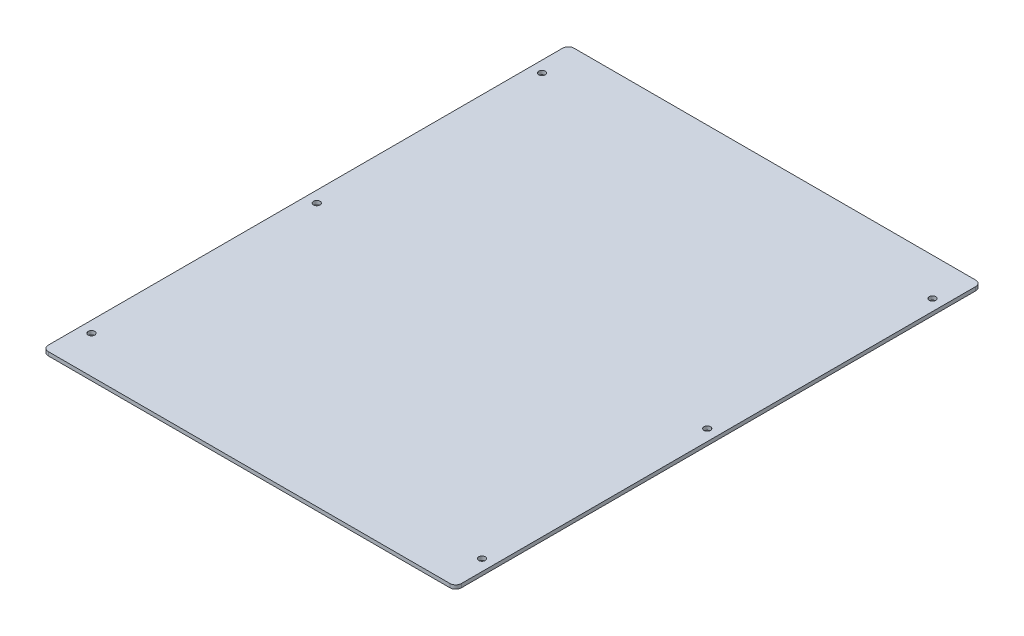
ISO-10303-21;
HEADER;
FILE_DESCRIPTION(('STEP AP214'),'2;1');
FILE_NAME('part.step','',(''),(''),'','','');
FILE_SCHEMA(('AUTOMOTIVE_DESIGN { 1 0 10303 214 1 1 1 1 }'));
ENDSEC;
DATA;
#1=APPLICATION_CONTEXT('core data for automotive mechanical design processes');
#2=APPLICATION_PROTOCOL_DEFINITION('international standard','automotive_design',2000,#1);
#3=PRODUCT_CONTEXT('',#1,'mechanical');
#4=PRODUCT('Part','Part','',(#3));
#5=PRODUCT_RELATED_PRODUCT_CATEGORY('part','',(#4));
#6=PRODUCT_DEFINITION_FORMATION('','',#4);
#7=PRODUCT_DEFINITION_CONTEXT('part definition',#1,'design');
#8=PRODUCT_DEFINITION('design','',#6,#7);
#9=PRODUCT_DEFINITION_SHAPE('','',#8);
#10=(LENGTH_UNIT() NAMED_UNIT(*) SI_UNIT(.MILLI.,.METRE.));
#11=(NAMED_UNIT(*) PLANE_ANGLE_UNIT() SI_UNIT($,.RADIAN.));
#12=(NAMED_UNIT(*) SI_UNIT($,.STERADIAN.) SOLID_ANGLE_UNIT());
#13=UNCERTAINTY_MEASURE_WITH_UNIT(LENGTH_MEASURE(1.E-05),#10,'distance_accuracy_value','');
#14=(GEOMETRIC_REPRESENTATION_CONTEXT(3) GLOBAL_UNCERTAINTY_ASSIGNED_CONTEXT((#13)) GLOBAL_UNIT_ASSIGNED_CONTEXT((#10,
#11,#12)) REPRESENTATION_CONTEXT('',''));
#15=CARTESIAN_POINT('',(0.,0.,0.));
#16=DIRECTION('',(0.,0.,1.));
#17=DIRECTION('',(1.,0.,0.));
#18=AXIS2_PLACEMENT_3D('',#15,#16,#17);
#19=CARTESIAN_POINT('',(110.,2.,140.));
#20=DIRECTION('',(-1.,0.,0.));
#21=DIRECTION('',(0.,0.,1.));
#22=AXIS2_PLACEMENT_3D('',#19,#20,#21);
#23=PLANE('',#22);
#24=DIRECTION('',(0.,0.,-1.));
#25=VECTOR('',#24,1.);
#26=CARTESIAN_POINT('',(110.,2.,140.));
#27=LINE('',#26,#25);
#28=CARTESIAN_POINT('',(110.,2.,137.));
#29=VERTEX_POINT('',#28);
#30=CARTESIAN_POINT('',(110.,2.,-137.));
#31=VERTEX_POINT('',#30);
#32=EDGE_CURVE('E125',#29,#31,#27,.T.);
#33=ORIENTED_EDGE('',*,*,#32,.F.);
#34=DIRECTION('',(0.,-1.,0.));
#35=VECTOR('',#34,1.);
#36=CARTESIAN_POINT('',(110.,2.,137.));
#37=LINE('',#36,#35);
#38=CARTESIAN_POINT('',(110.,0.,137.));
#39=VERTEX_POINT('',#38);
#40=EDGE_CURVE('E151',#29,#39,#37,.T.);
#41=ORIENTED_EDGE('',*,*,#40,.T.);
#42=DIRECTION('',(0.,0.,-1.));
#43=VECTOR('',#42,1.);
#44=CARTESIAN_POINT('',(110.,0.,140.));
#45=LINE('',#44,#43);
#46=CARTESIAN_POINT('',(110.,0.,-137.));
#47=VERTEX_POINT('',#46);
#48=EDGE_CURVE('E157',#39,#47,#45,.T.);
#49=ORIENTED_EDGE('',*,*,#48,.T.);
#50=DIRECTION('',(0.,-1.,0.));
#51=VECTOR('',#50,1.);
#52=CARTESIAN_POINT('',(110.,2.,-137.));
#53=LINE('',#52,#51);
#54=EDGE_CURVE('E149',#47,#31,#53,.F.);
#55=ORIENTED_EDGE('',*,*,#54,.T.);
#56=EDGE_LOOP('',(#33,#41,#49,#55));
#57=FACE_BOUND('',#56,.T.);
#58=ADVANCED_FACE('F33',(#57),#23,.F.);
#59=CARTESIAN_POINT('',(-110.,2.,-140.));
#60=DIRECTION('',(0.,0.,1.));
#61=DIRECTION('',(1.,0.,0.));
#62=AXIS2_PLACEMENT_3D('',#59,#60,#61);
#63=PLANE('',#62);
#64=DIRECTION('',(-1.,0.,0.));
#65=VECTOR('',#64,1.);
#66=CARTESIAN_POINT('',(-110.,2.,-140.));
#67=LINE('',#66,#65);
#68=CARTESIAN_POINT('',(107.,2.,-140.));
#69=VERTEX_POINT('',#68);
#70=CARTESIAN_POINT('',(-107.,2.,-140.));
#71=VERTEX_POINT('',#70);
#72=EDGE_CURVE('E128',#69,#71,#67,.T.);
#73=ORIENTED_EDGE('',*,*,#72,.F.);
#74=DIRECTION('',(0.,-1.,0.));
#75=VECTOR('',#74,1.);
#76=CARTESIAN_POINT('',(107.,2.,-140.));
#77=LINE('',#76,#75);
#78=CARTESIAN_POINT('',(107.,0.,-140.));
#79=VERTEX_POINT('',#78);
#80=EDGE_CURVE('E11',#69,#79,#77,.T.);
#81=ORIENTED_EDGE('',*,*,#80,.T.);
#82=DIRECTION('',(-1.,0.,0.));
#83=VECTOR('',#82,1.);
#84=CARTESIAN_POINT('',(-110.,0.,-140.));
#85=LINE('',#84,#83);
#86=CARTESIAN_POINT('',(-107.,0.,-140.));
#87=VERTEX_POINT('',#86);
#88=EDGE_CURVE('E130',#79,#87,#85,.T.);
#89=ORIENTED_EDGE('',*,*,#88,.T.);
#90=DIRECTION('',(0.,-1.,0.));
#91=VECTOR('',#90,1.);
#92=CARTESIAN_POINT('',(-107.,2.,-140.));
#93=LINE('',#92,#91);
#94=EDGE_CURVE('E41',#87,#71,#93,.F.);
#95=ORIENTED_EDGE('',*,*,#94,.T.);
#96=EDGE_LOOP('',(#73,#81,#89,#95));
#97=FACE_BOUND('',#96,.T.);
#98=ADVANCED_FACE('F227',(#97),#63,.F.);
#99=CARTESIAN_POINT('',(-110.,2.,140.));
#100=DIRECTION('',(1.,0.,0.));
#101=DIRECTION('',(0.,0.,-1.));
#102=AXIS2_PLACEMENT_3D('',#99,#100,#101);
#103=PLANE('',#102);
#104=DIRECTION('',(0.,0.,1.));
#105=VECTOR('',#104,1.);
#106=CARTESIAN_POINT('',(-110.,0.,140.));
#107=LINE('',#106,#105);
#108=CARTESIAN_POINT('',(-110.,0.,-137.));
#109=VERTEX_POINT('',#108);
#110=CARTESIAN_POINT('',(-110.,0.,137.));
#111=VERTEX_POINT('',#110);
#112=EDGE_CURVE('E126',#109,#111,#107,.T.);
#113=ORIENTED_EDGE('',*,*,#112,.T.);
#114=DIRECTION('',(0.,-1.,0.));
#115=VECTOR('',#114,1.);
#116=CARTESIAN_POINT('',(-110.,2.,137.));
#117=LINE('',#116,#115);
#118=CARTESIAN_POINT('',(-110.,2.,137.));
#119=VERTEX_POINT('',#118);
#120=EDGE_CURVE('E104',#111,#119,#117,.F.);
#121=ORIENTED_EDGE('',*,*,#120,.T.);
#122=DIRECTION('',(0.,0.,1.));
#123=VECTOR('',#122,1.);
#124=CARTESIAN_POINT('',(-110.,2.,140.));
#125=LINE('',#124,#123);
#126=CARTESIAN_POINT('',(-110.,2.,-137.));
#127=VERTEX_POINT('',#126);
#128=EDGE_CURVE('E169',#127,#119,#125,.T.);
#129=ORIENTED_EDGE('',*,*,#128,.F.);
#130=DIRECTION('',(0.,-1.,0.));
#131=VECTOR('',#130,1.);
#132=CARTESIAN_POINT('',(-110.,2.,-137.));
#133=LINE('',#132,#131);
#134=EDGE_CURVE('E109',#127,#109,#133,.T.);
#135=ORIENTED_EDGE('',*,*,#134,.T.);
#136=EDGE_LOOP('',(#113,#121,#129,#135));
#137=FACE_BOUND('',#136,.T.);
#138=ADVANCED_FACE('F225',(#137),#103,.F.);
#139=CARTESIAN_POINT('',(-110.,2.,140.));
#140=DIRECTION('',(0.,0.,-1.));
#141=DIRECTION('',(-1.,0.,0.));
#142=AXIS2_PLACEMENT_3D('',#139,#140,#141);
#143=PLANE('',#142);
#144=DIRECTION('',(1.,0.,0.));
#145=VECTOR('',#144,1.);
#146=CARTESIAN_POINT('',(-110.,2.,140.));
#147=LINE('',#146,#145);
#148=CARTESIAN_POINT('',(-107.,2.,140.));
#149=VERTEX_POINT('',#148);
#150=CARTESIAN_POINT('',(107.,2.,140.));
#151=VERTEX_POINT('',#150);
#152=EDGE_CURVE('E119',#149,#151,#147,.T.);
#153=ORIENTED_EDGE('',*,*,#152,.F.);
#154=DIRECTION('',(0.,-1.,0.));
#155=VECTOR('',#154,1.);
#156=CARTESIAN_POINT('',(-107.,2.,140.));
#157=LINE('',#156,#155);
#158=CARTESIAN_POINT('',(-107.,0.,140.));
#159=VERTEX_POINT('',#158);
#160=EDGE_CURVE('E103',#149,#159,#157,.T.);
#161=ORIENTED_EDGE('',*,*,#160,.T.);
#162=DIRECTION('',(1.,0.,0.));
#163=VECTOR('',#162,1.);
#164=CARTESIAN_POINT('',(-110.,0.,140.));
#165=LINE('',#164,#163);
#166=CARTESIAN_POINT('',(107.,0.,140.));
#167=VERTEX_POINT('',#166);
#168=EDGE_CURVE('E116',#159,#167,#165,.T.);
#169=ORIENTED_EDGE('',*,*,#168,.T.);
#170=DIRECTION('',(0.,-1.,0.));
#171=VECTOR('',#170,1.);
#172=CARTESIAN_POINT('',(107.,2.,140.));
#173=LINE('',#172,#171);
#174=EDGE_CURVE('E121',#167,#151,#173,.F.);
#175=ORIENTED_EDGE('',*,*,#174,.T.);
#176=EDGE_LOOP('',(#153,#161,#169,#175));
#177=FACE_BOUND('',#176,.T.);
#178=ADVANCED_FACE('F115',(#177),#143,.F.);
#179=CARTESIAN_POINT('',(0.,2.,0.));
#180=DIRECTION('',(0.,-1.,0.));
#181=DIRECTION('',(0.,0.,-1.));
#182=AXIS2_PLACEMENT_3D('',#179,#180,#181);
#183=PLANE('',#182);
#184=CARTESIAN_POINT('',(-104.,2.,120.));
#185=DIRECTION('',(0.,1.,0.));
#186=DIRECTION('',(0.,0.,1.));
#187=AXIS2_PLACEMENT_3D('',#184,#185,#186);
#188=CIRCLE('',#187,1.75);
#189=CARTESIAN_POINT('',(-104.,2.,121.75));
#190=VERTEX_POINT('',#189);
#191=EDGE_CURVE('E202',#190,#190,#188,.T.);
#192=ORIENTED_EDGE('',*,*,#191,.F.);
#193=EDGE_LOOP('',(#192));
#194=FACE_BOUND('',#193,.T.);
#195=CARTESIAN_POINT('',(104.,2.,120.));
#196=DIRECTION('',(0.,1.,0.));
#197=DIRECTION('',(0.,0.,1.));
#198=AXIS2_PLACEMENT_3D('',#195,#196,#197);
#199=CIRCLE('',#198,1.75);
#200=CARTESIAN_POINT('',(104.,2.,121.75));
#201=VERTEX_POINT('',#200);
#202=EDGE_CURVE('E196',#201,#201,#199,.T.);
#203=ORIENTED_EDGE('',*,*,#202,.F.);
#204=EDGE_LOOP('',(#203));
#205=FACE_BOUND('',#204,.T.);
#206=CARTESIAN_POINT('',(104.,2.,-120.));
#207=DIRECTION('',(0.,1.,0.));
#208=DIRECTION('',(0.,0.,1.));
#209=AXIS2_PLACEMENT_3D('',#206,#207,#208);
#210=CIRCLE('',#209,1.75);
#211=CARTESIAN_POINT('',(104.,2.,-118.25));
#212=VERTEX_POINT('',#211);
#213=EDGE_CURVE('E190',#212,#212,#210,.T.);
#214=ORIENTED_EDGE('',*,*,#213,.F.);
#215=EDGE_LOOP('',(#214));
#216=FACE_BOUND('',#215,.T.);
#217=CARTESIAN_POINT('',(-104.,2.,-120.));
#218=DIRECTION('',(0.,1.,0.));
#219=DIRECTION('',(0.,0.,1.));
#220=AXIS2_PLACEMENT_3D('',#217,#218,#219);
#221=CIRCLE('',#220,1.75);
#222=CARTESIAN_POINT('',(-104.,2.,-118.25));
#223=VERTEX_POINT('',#222);
#224=EDGE_CURVE('E184',#223,#223,#221,.T.);
#225=ORIENTED_EDGE('',*,*,#224,.F.);
#226=EDGE_LOOP('',(#225));
#227=FACE_BOUND('',#226,.T.);
#228=CARTESIAN_POINT('',(104.,2.,0.));
#229=DIRECTION('',(0.,1.,0.));
#230=DIRECTION('',(0.,0.,1.));
#231=AXIS2_PLACEMENT_3D('',#228,#229,#230);
#232=CIRCLE('',#231,1.75);
#233=CARTESIAN_POINT('',(104.,2.,1.75));
#234=VERTEX_POINT('',#233);
#235=EDGE_CURVE('E178',#234,#234,#232,.T.);
#236=ORIENTED_EDGE('',*,*,#235,.F.);
#237=EDGE_LOOP('',(#236));
#238=FACE_BOUND('',#237,.T.);
#239=CARTESIAN_POINT('',(-104.,2.,0.));
#240=DIRECTION('',(0.,1.,0.));
#241=DIRECTION('',(0.,0.,1.));
#242=AXIS2_PLACEMENT_3D('',#239,#240,#241);
#243=CIRCLE('',#242,1.75);
#244=CARTESIAN_POINT('',(-104.,2.,1.75));
#245=VERTEX_POINT('',#244);
#246=EDGE_CURVE('E165',#245,#245,#243,.T.);
#247=ORIENTED_EDGE('',*,*,#246,.F.);
#248=EDGE_LOOP('',(#247));
#249=FACE_BOUND('',#248,.T.);
#250=ORIENTED_EDGE('',*,*,#128,.T.);
#251=CARTESIAN_POINT('',(-107.,2.,137.));
#252=DIRECTION('',(0.,-1.,0.));
#253=DIRECTION('',(0.,0.,-1.));
#254=AXIS2_PLACEMENT_3D('',#251,#252,#253);
#255=CIRCLE('',#254,3.);
#256=EDGE_CURVE('E147',#119,#149,#255,.F.);
#257=ORIENTED_EDGE('',*,*,#256,.T.);
#258=ORIENTED_EDGE('',*,*,#152,.T.);
#259=CARTESIAN_POINT('',(107.,2.,137.));
#260=DIRECTION('',(0.,-1.,0.));
#261=DIRECTION('',(0.,0.,-1.));
#262=AXIS2_PLACEMENT_3D('',#259,#260,#261);
#263=CIRCLE('',#262,3.);
#264=EDGE_CURVE('E145',#151,#29,#263,.F.);
#265=ORIENTED_EDGE('',*,*,#264,.T.);
#266=ORIENTED_EDGE('',*,*,#32,.T.);
#267=CARTESIAN_POINT('',(107.,2.,-137.));
#268=DIRECTION('',(0.,-1.,0.));
#269=DIRECTION('',(0.,0.,-1.));
#270=AXIS2_PLACEMENT_3D('',#267,#268,#269);
#271=CIRCLE('',#270,3.);
#272=EDGE_CURVE('E54',#31,#69,#271,.F.);
#273=ORIENTED_EDGE('',*,*,#272,.T.);
#274=ORIENTED_EDGE('',*,*,#72,.T.);
#275=CARTESIAN_POINT('',(-107.,2.,-137.));
#276=DIRECTION('',(0.,-1.,0.));
#277=DIRECTION('',(0.,0.,-1.));
#278=AXIS2_PLACEMENT_3D('',#275,#276,#277);
#279=CIRCLE('',#278,3.);
#280=EDGE_CURVE('E142',#71,#127,#279,.F.);
#281=ORIENTED_EDGE('',*,*,#280,.T.);
#282=EDGE_LOOP('',(#250,#257,#258,#265,#266,#273,#274,#281));
#283=FACE_BOUND('',#282,.T.);
#284=ADVANCED_FACE('F208',(#194,#205,#216,#227,#238,#249,#283),#183,.F.);
#285=CARTESIAN_POINT('',(0.,0.,0.));
#286=DIRECTION('',(0.,-1.,0.));
#287=DIRECTION('',(0.,0.,-1.));
#288=AXIS2_PLACEMENT_3D('',#285,#286,#287);
#289=PLANE('',#288);
#290=CARTESIAN_POINT('',(-104.,0.,120.));
#291=DIRECTION('',(0.,1.,0.));
#292=DIRECTION('',(0.,0.,1.));
#293=AXIS2_PLACEMENT_3D('',#290,#291,#292);
#294=CIRCLE('',#293,1.75);
#295=CARTESIAN_POINT('',(-104.,0.,121.75));
#296=VERTEX_POINT('',#295);
#297=EDGE_CURVE('E199',#296,#296,#294,.T.);
#298=ORIENTED_EDGE('',*,*,#297,.T.);
#299=EDGE_LOOP('',(#298));
#300=FACE_BOUND('',#299,.T.);
#301=CARTESIAN_POINT('',(104.,0.,120.));
#302=DIRECTION('',(0.,1.,0.));
#303=DIRECTION('',(0.,0.,1.));
#304=AXIS2_PLACEMENT_3D('',#301,#302,#303);
#305=CIRCLE('',#304,1.75);
#306=CARTESIAN_POINT('',(104.,0.,121.75));
#307=VERTEX_POINT('',#306);
#308=EDGE_CURVE('E193',#307,#307,#305,.T.);
#309=ORIENTED_EDGE('',*,*,#308,.T.);
#310=EDGE_LOOP('',(#309));
#311=FACE_BOUND('',#310,.T.);
#312=CARTESIAN_POINT('',(104.,0.,-120.));
#313=DIRECTION('',(0.,1.,0.));
#314=DIRECTION('',(0.,0.,1.));
#315=AXIS2_PLACEMENT_3D('',#312,#313,#314);
#316=CIRCLE('',#315,1.75);
#317=CARTESIAN_POINT('',(104.,0.,-118.25));
#318=VERTEX_POINT('',#317);
#319=EDGE_CURVE('E187',#318,#318,#316,.T.);
#320=ORIENTED_EDGE('',*,*,#319,.T.);
#321=EDGE_LOOP('',(#320));
#322=FACE_BOUND('',#321,.T.);
#323=CARTESIAN_POINT('',(-104.,0.,-120.));
#324=DIRECTION('',(0.,1.,0.));
#325=DIRECTION('',(0.,0.,1.));
#326=AXIS2_PLACEMENT_3D('',#323,#324,#325);
#327=CIRCLE('',#326,1.75);
#328=CARTESIAN_POINT('',(-104.,0.,-118.25));
#329=VERTEX_POINT('',#328);
#330=EDGE_CURVE('E181',#329,#329,#327,.T.);
#331=ORIENTED_EDGE('',*,*,#330,.T.);
#332=EDGE_LOOP('',(#331));
#333=FACE_BOUND('',#332,.T.);
#334=CARTESIAN_POINT('',(104.,0.,0.));
#335=DIRECTION('',(0.,1.,0.));
#336=DIRECTION('',(0.,0.,1.));
#337=AXIS2_PLACEMENT_3D('',#334,#335,#336);
#338=CIRCLE('',#337,1.75);
#339=CARTESIAN_POINT('',(104.,0.,1.75));
#340=VERTEX_POINT('',#339);
#341=EDGE_CURVE('E175',#340,#340,#338,.T.);
#342=ORIENTED_EDGE('',*,*,#341,.T.);
#343=EDGE_LOOP('',(#342));
#344=FACE_BOUND('',#343,.T.);
#345=CARTESIAN_POINT('',(-104.,0.,0.));
#346=DIRECTION('',(0.,1.,0.));
#347=DIRECTION('',(0.,0.,1.));
#348=AXIS2_PLACEMENT_3D('',#345,#346,#347);
#349=CIRCLE('',#348,1.75);
#350=CARTESIAN_POINT('',(-104.,0.,1.75));
#351=VERTEX_POINT('',#350);
#352=EDGE_CURVE('E162',#351,#351,#349,.T.);
#353=ORIENTED_EDGE('',*,*,#352,.T.);
#354=EDGE_LOOP('',(#353));
#355=FACE_BOUND('',#354,.T.);
#356=ORIENTED_EDGE('',*,*,#168,.F.);
#357=CARTESIAN_POINT('',(-107.,0.,137.));
#358=DIRECTION('',(0.,-1.,0.));
#359=DIRECTION('',(0.,0.,-1.));
#360=AXIS2_PLACEMENT_3D('',#357,#358,#359);
#361=CIRCLE('',#360,3.);
#362=EDGE_CURVE('E99',#159,#111,#361,.T.);
#363=ORIENTED_EDGE('',*,*,#362,.T.);
#364=ORIENTED_EDGE('',*,*,#112,.F.);
#365=CARTESIAN_POINT('',(-107.,0.,-137.));
#366=DIRECTION('',(0.,-1.,0.));
#367=DIRECTION('',(0.,0.,-1.));
#368=AXIS2_PLACEMENT_3D('',#365,#366,#367);
#369=CIRCLE('',#368,3.);
#370=EDGE_CURVE('E120',#109,#87,#369,.T.);
#371=ORIENTED_EDGE('',*,*,#370,.T.);
#372=ORIENTED_EDGE('',*,*,#88,.F.);
#373=CARTESIAN_POINT('',(107.,0.,-137.));
#374=DIRECTION('',(0.,-1.,0.));
#375=DIRECTION('',(0.,0.,-1.));
#376=AXIS2_PLACEMENT_3D('',#373,#374,#375);
#377=CIRCLE('',#376,3.);
#378=EDGE_CURVE('E136',#79,#47,#377,.T.);
#379=ORIENTED_EDGE('',*,*,#378,.T.);
#380=ORIENTED_EDGE('',*,*,#48,.F.);
#381=CARTESIAN_POINT('',(107.,0.,137.));
#382=DIRECTION('',(0.,-1.,0.));
#383=DIRECTION('',(0.,0.,-1.));
#384=AXIS2_PLACEMENT_3D('',#381,#382,#383);
#385=CIRCLE('',#384,3.);
#386=EDGE_CURVE('E110',#39,#167,#385,.T.);
#387=ORIENTED_EDGE('',*,*,#386,.T.);
#388=EDGE_LOOP('',(#356,#363,#364,#371,#372,#379,#380,#387));
#389=FACE_BOUND('',#388,.T.);
#390=ADVANCED_FACE('F123',(#300,#311,#322,#333,#344,#355,#389),#289,.T.);
#391=CARTESIAN_POINT('',(-104.,2.,0.));
#392=DIRECTION('',(0.,1.,0.));
#393=DIRECTION('',(0.,0.,1.));
#394=AXIS2_PLACEMENT_3D('',#391,#392,#393);
#395=CYLINDRICAL_SURFACE('',#394,1.75);
#396=ORIENTED_EDGE('',*,*,#352,.F.);
#397=EDGE_LOOP('',(#396));
#398=FACE_BOUND('',#397,.T.);
#399=ORIENTED_EDGE('',*,*,#246,.T.);
#400=EDGE_LOOP('',(#399));
#401=FACE_BOUND('',#400,.T.);
#402=ADVANCED_FACE('F252',(#398,#401),#395,.F.);
#403=CARTESIAN_POINT('',(104.,2.,0.));
#404=DIRECTION('',(0.,1.,0.));
#405=DIRECTION('',(0.,0.,1.));
#406=AXIS2_PLACEMENT_3D('',#403,#404,#405);
#407=CYLINDRICAL_SURFACE('',#406,1.75);
#408=ORIENTED_EDGE('',*,*,#341,.F.);
#409=EDGE_LOOP('',(#408));
#410=FACE_BOUND('',#409,.T.);
#411=ORIENTED_EDGE('',*,*,#235,.T.);
#412=EDGE_LOOP('',(#411));
#413=FACE_BOUND('',#412,.T.);
#414=ADVANCED_FACE('F257',(#410,#413),#407,.F.);
#415=CARTESIAN_POINT('',(-104.,2.,-120.));
#416=DIRECTION('',(0.,1.,0.));
#417=DIRECTION('',(0.,0.,1.));
#418=AXIS2_PLACEMENT_3D('',#415,#416,#417);
#419=CYLINDRICAL_SURFACE('',#418,1.75);
#420=ORIENTED_EDGE('',*,*,#330,.F.);
#421=EDGE_LOOP('',(#420));
#422=FACE_BOUND('',#421,.T.);
#423=ORIENTED_EDGE('',*,*,#224,.T.);
#424=EDGE_LOOP('',(#423));
#425=FACE_BOUND('',#424,.T.);
#426=ADVANCED_FACE('F261',(#422,#425),#419,.F.);
#427=CARTESIAN_POINT('',(104.,2.,-120.));
#428=DIRECTION('',(0.,1.,0.));
#429=DIRECTION('',(0.,0.,1.));
#430=AXIS2_PLACEMENT_3D('',#427,#428,#429);
#431=CYLINDRICAL_SURFACE('',#430,1.75);
#432=ORIENTED_EDGE('',*,*,#319,.F.);
#433=EDGE_LOOP('',(#432));
#434=FACE_BOUND('',#433,.T.);
#435=ORIENTED_EDGE('',*,*,#213,.T.);
#436=EDGE_LOOP('',(#435));
#437=FACE_BOUND('',#436,.T.);
#438=ADVANCED_FACE('F265',(#434,#437),#431,.F.);
#439=CARTESIAN_POINT('',(104.,2.,120.));
#440=DIRECTION('',(0.,1.,0.));
#441=DIRECTION('',(0.,0.,1.));
#442=AXIS2_PLACEMENT_3D('',#439,#440,#441);
#443=CYLINDRICAL_SURFACE('',#442,1.75);
#444=ORIENTED_EDGE('',*,*,#308,.F.);
#445=EDGE_LOOP('',(#444));
#446=FACE_BOUND('',#445,.T.);
#447=ORIENTED_EDGE('',*,*,#202,.T.);
#448=EDGE_LOOP('',(#447));
#449=FACE_BOUND('',#448,.T.);
#450=ADVANCED_FACE('F269',(#446,#449),#443,.F.);
#451=CARTESIAN_POINT('',(-104.,2.,120.));
#452=DIRECTION('',(0.,1.,0.));
#453=DIRECTION('',(0.,0.,1.));
#454=AXIS2_PLACEMENT_3D('',#451,#452,#453);
#455=CYLINDRICAL_SURFACE('',#454,1.75);
#456=ORIENTED_EDGE('',*,*,#297,.F.);
#457=EDGE_LOOP('',(#456));
#458=FACE_BOUND('',#457,.T.);
#459=ORIENTED_EDGE('',*,*,#191,.T.);
#460=EDGE_LOOP('',(#459));
#461=FACE_BOUND('',#460,.T.);
#462=ADVANCED_FACE('F206',(#458,#461),#455,.F.);
#463=CARTESIAN_POINT('',(-107.,2.,137.));
#464=DIRECTION('',(0.,-1.,0.));
#465=DIRECTION('',(0.,0.,-1.));
#466=AXIS2_PLACEMENT_3D('',#463,#464,#465);
#467=CYLINDRICAL_SURFACE('',#466,3.);
#468=ORIENTED_EDGE('',*,*,#256,.F.);
#469=ORIENTED_EDGE('',*,*,#120,.F.);
#470=ORIENTED_EDGE('',*,*,#362,.F.);
#471=ORIENTED_EDGE('',*,*,#160,.F.);
#472=EDGE_LOOP('',(#468,#469,#470,#471));
#473=FACE_BOUND('',#472,.T.);
#474=ADVANCED_FACE('F102',(#473),#467,.T.);
#475=CARTESIAN_POINT('',(107.,2.,137.));
#476=DIRECTION('',(0.,-1.,0.));
#477=DIRECTION('',(0.,0.,-1.));
#478=AXIS2_PLACEMENT_3D('',#475,#476,#477);
#479=CYLINDRICAL_SURFACE('',#478,3.);
#480=ORIENTED_EDGE('',*,*,#264,.F.);
#481=ORIENTED_EDGE('',*,*,#174,.F.);
#482=ORIENTED_EDGE('',*,*,#386,.F.);
#483=ORIENTED_EDGE('',*,*,#40,.F.);
#484=EDGE_LOOP('',(#480,#481,#482,#483));
#485=FACE_BOUND('',#484,.T.);
#486=ADVANCED_FACE('F231',(#485),#479,.T.);
#487=CARTESIAN_POINT('',(107.,2.,-137.));
#488=DIRECTION('',(0.,-1.,0.));
#489=DIRECTION('',(0.,0.,-1.));
#490=AXIS2_PLACEMENT_3D('',#487,#488,#489);
#491=CYLINDRICAL_SURFACE('',#490,3.);
#492=ORIENTED_EDGE('',*,*,#272,.F.);
#493=ORIENTED_EDGE('',*,*,#54,.F.);
#494=ORIENTED_EDGE('',*,*,#378,.F.);
#495=ORIENTED_EDGE('',*,*,#80,.F.);
#496=EDGE_LOOP('',(#492,#493,#494,#495));
#497=FACE_BOUND('',#496,.T.);
#498=ADVANCED_FACE('F230',(#497),#491,.T.);
#499=CARTESIAN_POINT('',(-107.,2.,-137.));
#500=DIRECTION('',(0.,-1.,0.));
#501=DIRECTION('',(0.,0.,-1.));
#502=AXIS2_PLACEMENT_3D('',#499,#500,#501);
#503=CYLINDRICAL_SURFACE('',#502,3.);
#504=ORIENTED_EDGE('',*,*,#280,.F.);
#505=ORIENTED_EDGE('',*,*,#94,.F.);
#506=ORIENTED_EDGE('',*,*,#370,.F.);
#507=ORIENTED_EDGE('',*,*,#134,.F.);
#508=EDGE_LOOP('',(#504,#505,#506,#507));
#509=FACE_BOUND('',#508,.T.);
#510=ADVANCED_FACE('F35',(#509),#503,.T.);
#511=CLOSED_SHELL('',(#58,#98,#138,#178,#284,#390,#402,#414,#426,#438,#450,#462,#474,#486,#498,#510));
#512=MANIFOLD_SOLID_BREP('B2',#511);
#513=ADVANCED_BREP_SHAPE_REPRESENTATION('',(#18,#512),#14);
#514=SHAPE_DEFINITION_REPRESENTATION(#9,#513);
ENDSEC;
END-ISO-10303-21;
